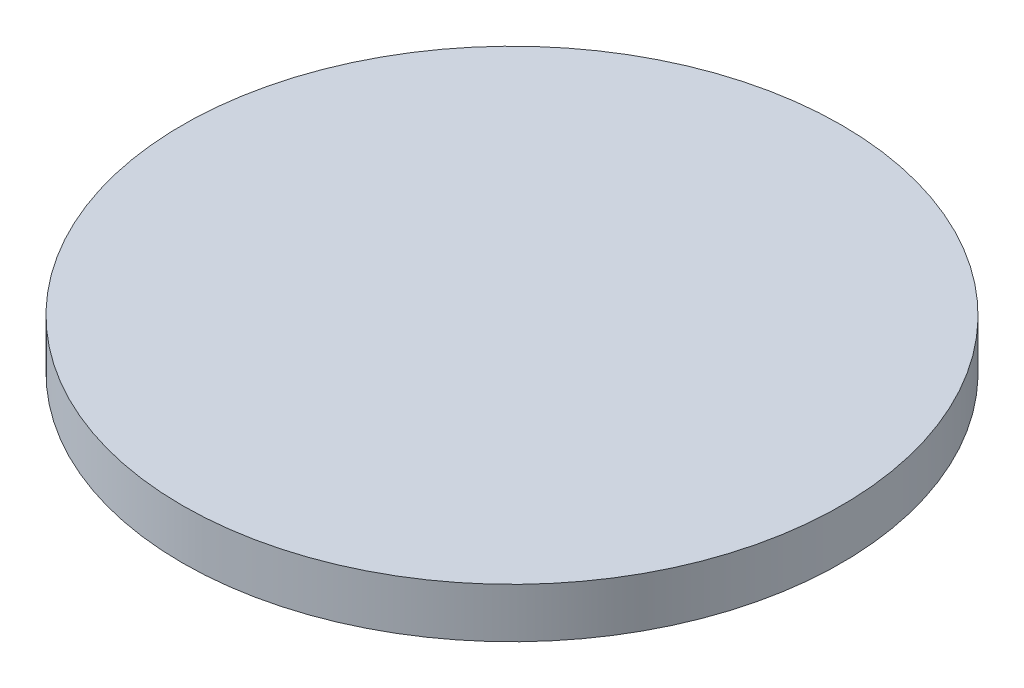
ISO-10303-21;
HEADER;
FILE_DESCRIPTION(('STEP AP214'),'2;1');
FILE_NAME('part.step','',(''),(''),'','','');
FILE_SCHEMA(('AUTOMOTIVE_DESIGN { 1 0 10303 214 1 1 1 1 }'));
ENDSEC;
DATA;
#1=APPLICATION_CONTEXT('core data for automotive mechanical design processes');
#2=APPLICATION_PROTOCOL_DEFINITION('international standard','automotive_design',2000,#1);
#3=PRODUCT_CONTEXT('',#1,'mechanical');
#4=PRODUCT('Part','Part','',(#3));
#5=PRODUCT_RELATED_PRODUCT_CATEGORY('part','',(#4));
#6=PRODUCT_DEFINITION_FORMATION('','',#4);
#7=PRODUCT_DEFINITION_CONTEXT('part definition',#1,'design');
#8=PRODUCT_DEFINITION('design','',#6,#7);
#9=PRODUCT_DEFINITION_SHAPE('','',#8);
#10=(LENGTH_UNIT() NAMED_UNIT(*) SI_UNIT(.MILLI.,.METRE.));
#11=(NAMED_UNIT(*) PLANE_ANGLE_UNIT() SI_UNIT($,.RADIAN.));
#12=(NAMED_UNIT(*) SI_UNIT($,.STERADIAN.) SOLID_ANGLE_UNIT());
#13=UNCERTAINTY_MEASURE_WITH_UNIT(LENGTH_MEASURE(1.E-05),#10,'distance_accuracy_value','');
#14=(GEOMETRIC_REPRESENTATION_CONTEXT(3) GLOBAL_UNCERTAINTY_ASSIGNED_CONTEXT((#13)) GLOBAL_UNIT_ASSIGNED_CONTEXT((#10,
#11,#12)) REPRESENTATION_CONTEXT('',''));
#15=CARTESIAN_POINT('',(0.,0.,0.));
#16=DIRECTION('',(0.,0.,1.));
#17=DIRECTION('',(1.,0.,0.));
#18=AXIS2_PLACEMENT_3D('',#15,#16,#17);
#19=CARTESIAN_POINT('',(0.,0.8,0.));
#20=DIRECTION('',(0.,-1.,0.));
#21=DIRECTION('',(0.,0.,-1.));
#22=AXIS2_PLACEMENT_3D('',#19,#20,#21);
#23=CYLINDRICAL_SURFACE('',#22,5.3);
#24=CARTESIAN_POINT('',(0.,0.8,0.));
#25=DIRECTION('',(0.,1.,0.));
#26=DIRECTION('',(0.,0.,1.));
#27=AXIS2_PLACEMENT_3D('',#24,#25,#26);
#28=CIRCLE('',#27,5.3);
#29=CARTESIAN_POINT('',(0.,0.8,5.3));
#30=VERTEX_POINT('',#29);
#31=EDGE_CURVE('E10',#30,#30,#28,.T.);
#32=ORIENTED_EDGE('',*,*,#31,.F.);
#33=EDGE_LOOP('',(#32));
#34=FACE_BOUND('',#33,.T.);
#35=CARTESIAN_POINT('',(0.,0.,0.));
#36=DIRECTION('',(0.,1.,0.));
#37=DIRECTION('',(0.,0.,1.));
#38=AXIS2_PLACEMENT_3D('',#35,#36,#37);
#39=CIRCLE('',#38,5.3);
#40=CARTESIAN_POINT('',(0.,0.,5.3));
#41=VERTEX_POINT('',#40);
#42=EDGE_CURVE('E34',#41,#41,#39,.T.);
#43=ORIENTED_EDGE('',*,*,#42,.T.);
#44=EDGE_LOOP('',(#43));
#45=FACE_BOUND('',#44,.T.);
#46=ADVANCED_FACE('F31',(#34,#45),#23,.T.);
#47=CARTESIAN_POINT('',(0.,0.8,0.));
#48=DIRECTION('',(0.,1.,0.));
#49=DIRECTION('',(0.,0.,1.));
#50=AXIS2_PLACEMENT_3D('',#47,#48,#49);
#51=PLANE('',#50);
#52=ORIENTED_EDGE('',*,*,#31,.T.);
#53=EDGE_LOOP('',(#52));
#54=FACE_BOUND('',#53,.T.);
#55=ADVANCED_FACE('F46',(#54),#51,.T.);
#56=CARTESIAN_POINT('',(0.,0.,0.));
#57=DIRECTION('',(0.,1.,0.));
#58=DIRECTION('',(0.,0.,1.));
#59=AXIS2_PLACEMENT_3D('',#56,#57,#58);
#60=PLANE('',#59);
#61=ORIENTED_EDGE('',*,*,#42,.F.);
#62=EDGE_LOOP('',(#61));
#63=FACE_BOUND('',#62,.T.);
#64=ADVANCED_FACE('F44',(#63),#60,.F.);
#65=CLOSED_SHELL('',(#46,#55,#64));
#66=MANIFOLD_SOLID_BREP('B2',#65);
#67=ADVANCED_BREP_SHAPE_REPRESENTATION('',(#18,#66),#14);
#68=SHAPE_DEFINITION_REPRESENTATION(#9,#67);
ENDSEC;
END-ISO-10303-21;
